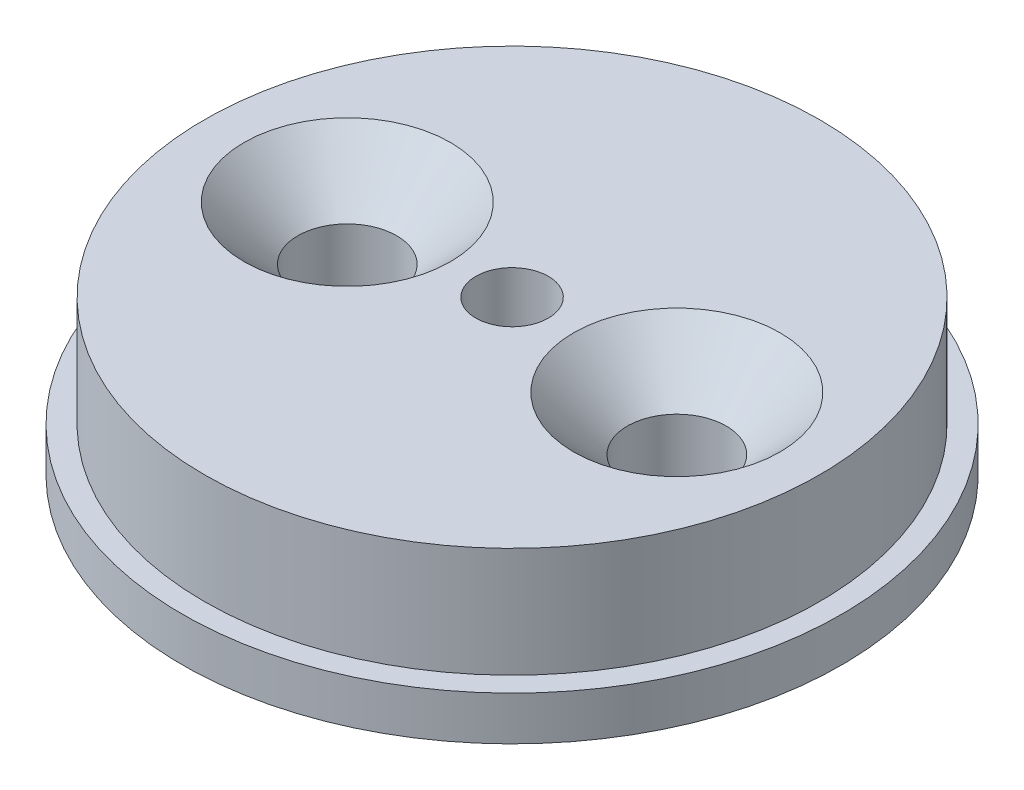
ISO-10303-21;
HEADER;
FILE_DESCRIPTION(('STEP AP214'),'2;1');
FILE_NAME('part.step','',(''),(''),'','','');
FILE_SCHEMA(('AUTOMOTIVE_DESIGN { 1 0 10303 214 1 1 1 1 }'));
ENDSEC;
DATA;
#1=APPLICATION_CONTEXT('core data for automotive mechanical design processes');
#2=APPLICATION_PROTOCOL_DEFINITION('international standard','automotive_design',2000,#1);
#3=PRODUCT_CONTEXT('',#1,'mechanical');
#4=PRODUCT('Part','Part','',(#3));
#5=PRODUCT_RELATED_PRODUCT_CATEGORY('part','',(#4));
#6=PRODUCT_DEFINITION_FORMATION('','',#4);
#7=PRODUCT_DEFINITION_CONTEXT('part definition',#1,'design');
#8=PRODUCT_DEFINITION('design','',#6,#7);
#9=PRODUCT_DEFINITION_SHAPE('','',#8);
#10=(LENGTH_UNIT() NAMED_UNIT(*) SI_UNIT(.MILLI.,.METRE.));
#11=(NAMED_UNIT(*) PLANE_ANGLE_UNIT() SI_UNIT($,.RADIAN.));
#12=(NAMED_UNIT(*) SI_UNIT($,.STERADIAN.) SOLID_ANGLE_UNIT());
#13=UNCERTAINTY_MEASURE_WITH_UNIT(LENGTH_MEASURE(1.E-05),#10,'distance_accuracy_value','');
#14=(GEOMETRIC_REPRESENTATION_CONTEXT(3) GLOBAL_UNCERTAINTY_ASSIGNED_CONTEXT((#13)) GLOBAL_UNIT_ASSIGNED_CONTEXT((#10,
#11,#12)) REPRESENTATION_CONTEXT('',''));
#15=CARTESIAN_POINT('',(0.,0.,0.));
#16=DIRECTION('',(0.,0.,1.));
#17=DIRECTION('',(1.,0.,0.));
#18=AXIS2_PLACEMENT_3D('',#15,#16,#17);
#19=CARTESIAN_POINT('',(0.,0.,0.));
#20=DIRECTION('',(0.,1.,0.));
#21=DIRECTION('',(0.,0.,1.));
#22=AXIS2_PLACEMENT_3D('',#19,#20,#21);
#23=PLANE('',#22);
#24=CARTESIAN_POINT('',(0.,0.,0.));
#25=DIRECTION('',(0.,-1.,0.));
#26=DIRECTION('',(0.,0.,-1.));
#27=AXIS2_PLACEMENT_3D('',#24,#25,#26);
#28=CIRCLE('',#27,3.75);
#29=CARTESIAN_POINT('',(0.,0.,-3.75));
#30=VERTEX_POINT('',#29);
#31=EDGE_CURVE('E84',#30,#30,#28,.T.);
#32=ORIENTED_EDGE('',*,*,#31,.F.);
#33=EDGE_LOOP('',(#32));
#34=FACE_BOUND('',#33,.T.);
#35=CARTESIAN_POINT('',(-7.5,0.,0.));
#36=DIRECTION('',(0.,1.,0.));
#37=DIRECTION('',(0.,0.,1.));
#38=AXIS2_PLACEMENT_3D('',#35,#36,#37);
#39=CIRCLE('',#38,2.25);
#40=CARTESIAN_POINT('',(-7.5,0.,2.25));
#41=VERTEX_POINT('',#40);
#42=EDGE_CURVE('E74',#41,#41,#39,.T.);
#43=ORIENTED_EDGE('',*,*,#42,.T.);
#44=EDGE_LOOP('',(#43));
#45=FACE_BOUND('',#44,.T.);
#46=CARTESIAN_POINT('',(7.5,0.,0.));
#47=DIRECTION('',(0.,1.,0.));
#48=DIRECTION('',(0.,0.,1.));
#49=AXIS2_PLACEMENT_3D('',#46,#47,#48);
#50=CIRCLE('',#49,2.25);
#51=CARTESIAN_POINT('',(7.5,0.,2.25));
#52=VERTEX_POINT('',#51);
#53=EDGE_CURVE('E65',#52,#52,#50,.T.);
#54=ORIENTED_EDGE('',*,*,#53,.T.);
#55=EDGE_LOOP('',(#54));
#56=FACE_BOUND('',#55,.T.);
#57=CARTESIAN_POINT('',(0.,0.,0.));
#58=DIRECTION('',(0.,-1.,0.));
#59=DIRECTION('',(0.,0.,-1.));
#60=AXIS2_PLACEMENT_3D('',#57,#58,#59);
#61=CIRCLE('',#60,15.);
#62=CARTESIAN_POINT('',(0.,0.,-15.));
#63=VERTEX_POINT('',#62);
#64=EDGE_CURVE('E12',#63,#63,#61,.T.);
#65=ORIENTED_EDGE('',*,*,#64,.T.);
#66=EDGE_LOOP('',(#65));
#67=FACE_BOUND('',#66,.T.);
#68=ADVANCED_FACE('F46',(#34,#45,#56,#67),#23,.F.);
#69=CARTESIAN_POINT('',(0.,0.,0.));
#70=DIRECTION('',(0.,-1.,0.));
#71=DIRECTION('',(0.,0.,-1.));
#72=AXIS2_PLACEMENT_3D('',#69,#70,#71);
#73=CYLINDRICAL_SURFACE('',#72,15.);
#74=ORIENTED_EDGE('',*,*,#64,.F.);
#75=EDGE_LOOP('',(#74));
#76=FACE_BOUND('',#75,.T.);
#77=CARTESIAN_POINT('',(0.,2.,0.));
#78=DIRECTION('',(0.,-1.,0.));
#79=DIRECTION('',(0.,0.,-1.));
#80=AXIS2_PLACEMENT_3D('',#77,#78,#79);
#81=CIRCLE('',#80,15.);
#82=CARTESIAN_POINT('',(0.,2.,-15.));
#83=VERTEX_POINT('',#82);
#84=EDGE_CURVE('E52',#83,#83,#81,.T.);
#85=ORIENTED_EDGE('',*,*,#84,.T.);
#86=EDGE_LOOP('',(#85));
#87=FACE_BOUND('',#86,.T.);
#88=ADVANCED_FACE('F113',(#76,#87),#73,.T.);
#89=CARTESIAN_POINT('',(-15.,2.,0.));
#90=DIRECTION('',(0.,-1.,0.));
#91=DIRECTION('',(0.,0.,-1.));
#92=AXIS2_PLACEMENT_3D('',#89,#90,#91);
#93=PLANE('',#92);
#94=ORIENTED_EDGE('',*,*,#84,.F.);
#95=EDGE_LOOP('',(#94));
#96=FACE_BOUND('',#95,.T.);
#97=CARTESIAN_POINT('',(0.,2.,0.));
#98=DIRECTION('',(0.,-1.,0.));
#99=DIRECTION('',(0.,0.,-1.));
#100=AXIS2_PLACEMENT_3D('',#97,#98,#99);
#101=CIRCLE('',#100,14.);
#102=CARTESIAN_POINT('',(0.,2.,-14.));
#103=VERTEX_POINT('',#102);
#104=EDGE_CURVE('E56',#103,#103,#101,.T.);
#105=ORIENTED_EDGE('',*,*,#104,.T.);
#106=EDGE_LOOP('',(#105));
#107=FACE_BOUND('',#106,.T.);
#108=ADVANCED_FACE('F140',(#96,#107),#93,.F.);
#109=CARTESIAN_POINT('',(0.,0.,0.));
#110=DIRECTION('',(0.,-1.,0.));
#111=DIRECTION('',(0.,0.,-1.));
#112=AXIS2_PLACEMENT_3D('',#109,#110,#111);
#113=CYLINDRICAL_SURFACE('',#112,14.);
#114=ORIENTED_EDGE('',*,*,#104,.F.);
#115=EDGE_LOOP('',(#114));
#116=FACE_BOUND('',#115,.T.);
#117=CARTESIAN_POINT('',(0.,7.,0.));
#118=DIRECTION('',(0.,-1.,0.));
#119=DIRECTION('',(0.,0.,-1.));
#120=AXIS2_PLACEMENT_3D('',#117,#118,#119);
#121=CIRCLE('',#120,14.);
#122=CARTESIAN_POINT('',(0.,7.,-14.));
#123=VERTEX_POINT('',#122);
#124=EDGE_CURVE('E60',#123,#123,#121,.T.);
#125=ORIENTED_EDGE('',*,*,#124,.T.);
#126=EDGE_LOOP('',(#125));
#127=FACE_BOUND('',#126,.T.);
#128=ADVANCED_FACE('F134',(#116,#127),#113,.T.);
#129=CARTESIAN_POINT('',(-14.,7.,0.));
#130=DIRECTION('',(0.,-1.,0.));
#131=DIRECTION('',(0.,0.,-1.));
#132=AXIS2_PLACEMENT_3D('',#129,#130,#131);
#133=PLANE('',#132);
#134=CARTESIAN_POINT('',(0.,7.,0.));
#135=DIRECTION('',(0.,-1.,0.));
#136=DIRECTION('',(0.,0.,-1.));
#137=AXIS2_PLACEMENT_3D('',#134,#135,#136);
#138=CIRCLE('',#137,1.64999999999999);
#139=CARTESIAN_POINT('',(0.,7.,-1.64999999999999));
#140=VERTEX_POINT('',#139);
#141=EDGE_CURVE('E87',#140,#140,#138,.T.);
#142=ORIENTED_EDGE('',*,*,#141,.T.);
#143=EDGE_LOOP('',(#142));
#144=FACE_BOUND('',#143,.T.);
#145=CARTESIAN_POINT('',(-7.5,7.,0.));
#146=DIRECTION('',(0.,1.,0.));
#147=DIRECTION('',(0.,0.,1.));
#148=AXIS2_PLACEMENT_3D('',#145,#146,#147);
#149=CIRCLE('',#148,4.7);
#150=CARTESIAN_POINT('',(-7.5,7.,4.7));
#151=VERTEX_POINT('',#150);
#152=EDGE_CURVE('E80',#151,#151,#149,.T.);
#153=ORIENTED_EDGE('',*,*,#152,.F.);
#154=EDGE_LOOP('',(#153));
#155=FACE_BOUND('',#154,.T.);
#156=CARTESIAN_POINT('',(7.5,7.,0.));
#157=DIRECTION('',(0.,1.,0.));
#158=DIRECTION('',(0.,0.,1.));
#159=AXIS2_PLACEMENT_3D('',#156,#157,#158);
#160=CIRCLE('',#159,4.7);
#161=CARTESIAN_POINT('',(7.5,7.,4.7));
#162=VERTEX_POINT('',#161);
#163=EDGE_CURVE('E71',#162,#162,#160,.T.);
#164=ORIENTED_EDGE('',*,*,#163,.F.);
#165=EDGE_LOOP('',(#164));
#166=FACE_BOUND('',#165,.T.);
#167=ORIENTED_EDGE('',*,*,#124,.F.);
#168=EDGE_LOOP('',(#167));
#169=FACE_BOUND('',#168,.T.);
#170=ADVANCED_FACE('F122',(#144,#155,#166,#169),#133,.F.);
#171=CARTESIAN_POINT('',(7.5,7.,0.));
#172=DIRECTION('',(0.,1.,0.));
#173=DIRECTION('',(0.,0.,1.));
#174=AXIS2_PLACEMENT_3D('',#171,#172,#173);
#175=CYLINDRICAL_SURFACE('',#174,2.25);
#176=ORIENTED_EDGE('',*,*,#53,.F.);
#177=EDGE_LOOP('',(#176));
#178=FACE_BOUND('',#177,.T.);
#179=CARTESIAN_POINT('',(7.5,4.55,0.));
#180=DIRECTION('',(0.,1.,0.));
#181=DIRECTION('',(0.,0.,1.));
#182=AXIS2_PLACEMENT_3D('',#179,#180,#181);
#183=CIRCLE('',#182,2.25);
#184=CARTESIAN_POINT('',(7.5,4.55,2.25));
#185=VERTEX_POINT('',#184);
#186=EDGE_CURVE('E68',#185,#185,#183,.T.);
#187=ORIENTED_EDGE('',*,*,#186,.T.);
#188=EDGE_LOOP('',(#187));
#189=FACE_BOUND('',#188,.T.);
#190=ADVANCED_FACE('F118',(#178,#189),#175,.F.);
#191=CARTESIAN_POINT('',(7.5,7.,0.));
#192=DIRECTION('',(0.,1.,0.));
#193=DIRECTION('',(0.,0.,1.));
#194=AXIS2_PLACEMENT_3D('',#191,#192,#193);
#195=CONICAL_SURFACE('',#194,4.7,0.785398163397448);
#196=ORIENTED_EDGE('',*,*,#186,.F.);
#197=EDGE_LOOP('',(#196));
#198=FACE_BOUND('',#197,.T.);
#199=ORIENTED_EDGE('',*,*,#163,.T.);
#200=EDGE_LOOP('',(#199));
#201=FACE_BOUND('',#200,.T.);
#202=ADVANCED_FACE('F121',(#198,#201),#195,.F.);
#203=CARTESIAN_POINT('',(-7.5,7.,0.));
#204=DIRECTION('',(0.,1.,0.));
#205=DIRECTION('',(0.,0.,1.));
#206=AXIS2_PLACEMENT_3D('',#203,#204,#205);
#207=CYLINDRICAL_SURFACE('',#206,2.25);
#208=ORIENTED_EDGE('',*,*,#42,.F.);
#209=EDGE_LOOP('',(#208));
#210=FACE_BOUND('',#209,.T.);
#211=CARTESIAN_POINT('',(-7.5,4.55,0.));
#212=DIRECTION('',(0.,1.,0.));
#213=DIRECTION('',(0.,0.,1.));
#214=AXIS2_PLACEMENT_3D('',#211,#212,#213);
#215=CIRCLE('',#214,2.25);
#216=CARTESIAN_POINT('',(-7.5,4.55,2.25));
#217=VERTEX_POINT('',#216);
#218=EDGE_CURVE('E77',#217,#217,#215,.T.);
#219=ORIENTED_EDGE('',*,*,#218,.T.);
#220=EDGE_LOOP('',(#219));
#221=FACE_BOUND('',#220,.T.);
#222=ADVANCED_FACE('F128',(#210,#221),#207,.F.);
#223=CARTESIAN_POINT('',(-7.5,7.,0.));
#224=DIRECTION('',(0.,1.,0.));
#225=DIRECTION('',(0.,0.,1.));
#226=AXIS2_PLACEMENT_3D('',#223,#224,#225);
#227=CONICAL_SURFACE('',#226,4.7,0.785398163397449);
#228=ORIENTED_EDGE('',*,*,#218,.F.);
#229=EDGE_LOOP('',(#228));
#230=FACE_BOUND('',#229,.T.);
#231=ORIENTED_EDGE('',*,*,#152,.T.);
#232=EDGE_LOOP('',(#231));
#233=FACE_BOUND('',#232,.T.);
#234=ADVANCED_FACE('F107',(#230,#233),#227,.F.);
#235=CARTESIAN_POINT('',(0.,3.,0.));
#236=DIRECTION('',(0.,-1.,0.));
#237=DIRECTION('',(0.,0.,-1.));
#238=AXIS2_PLACEMENT_3D('',#235,#236,#237);
#239=CYLINDRICAL_SURFACE('',#238,3.75);
#240=CARTESIAN_POINT('',(0.,3.,0.));
#241=DIRECTION('',(0.,-1.,0.));
#242=DIRECTION('',(0.,0.,-1.));
#243=AXIS2_PLACEMENT_3D('',#240,#241,#242);
#244=CIRCLE('',#243,3.75);
#245=CARTESIAN_POINT('',(0.,3.,-3.75));
#246=VERTEX_POINT('',#245);
#247=EDGE_CURVE('E83',#246,#246,#244,.T.);
#248=ORIENTED_EDGE('',*,*,#247,.F.);
#249=EDGE_LOOP('',(#248));
#250=FACE_BOUND('',#249,.T.);
#251=ORIENTED_EDGE('',*,*,#31,.T.);
#252=EDGE_LOOP('',(#251));
#253=FACE_BOUND('',#252,.T.);
#254=ADVANCED_FACE('F101',(#250,#253),#239,.F.);
#255=CARTESIAN_POINT('',(0.,3.,0.));
#256=DIRECTION('',(0.,-1.,0.));
#257=DIRECTION('',(0.,0.,-1.));
#258=AXIS2_PLACEMENT_3D('',#255,#256,#257);
#259=PLANE('',#258);
#260=CARTESIAN_POINT('',(0.,3.,0.));
#261=DIRECTION('',(0.,-1.,0.));
#262=DIRECTION('',(0.,0.,-1.));
#263=AXIS2_PLACEMENT_3D('',#260,#261,#262);
#264=CIRCLE('',#263,1.64999999999999);
#265=CARTESIAN_POINT('',(0.,3.,-1.64999999999999));
#266=VERTEX_POINT('',#265);
#267=EDGE_CURVE('E92',#266,#266,#264,.T.);
#268=ORIENTED_EDGE('',*,*,#267,.F.);
#269=EDGE_LOOP('',(#268));
#270=FACE_BOUND('',#269,.T.);
#271=ORIENTED_EDGE('',*,*,#247,.T.);
#272=EDGE_LOOP('',(#271));
#273=FACE_BOUND('',#272,.T.);
#274=ADVANCED_FACE('F98',(#270,#273),#259,.T.);
#275=CARTESIAN_POINT('',(0.,3.,0.));
#276=DIRECTION('',(0.,-1.,0.));
#277=DIRECTION('',(0.,0.,-1.));
#278=AXIS2_PLACEMENT_3D('',#275,#276,#277);
#279=CYLINDRICAL_SURFACE('',#278,1.64999999999999);
#280=ORIENTED_EDGE('',*,*,#141,.F.);
#281=EDGE_LOOP('',(#280));
#282=FACE_BOUND('',#281,.T.);
#283=ORIENTED_EDGE('',*,*,#267,.T.);
#284=EDGE_LOOP('',(#283));
#285=FACE_BOUND('',#284,.T.);
#286=ADVANCED_FACE('F96',(#282,#285),#279,.F.);
#287=CLOSED_SHELL('',(#68,#88,#108,#128,#170,#190,#202,#222,#234,#254,#274,#286));
#288=MANIFOLD_SOLID_BREP('B2',#287);
#289=ADVANCED_BREP_SHAPE_REPRESENTATION('',(#18,#288),#14);
#290=SHAPE_DEFINITION_REPRESENTATION(#9,#289);
ENDSEC;
END-ISO-10303-21;
